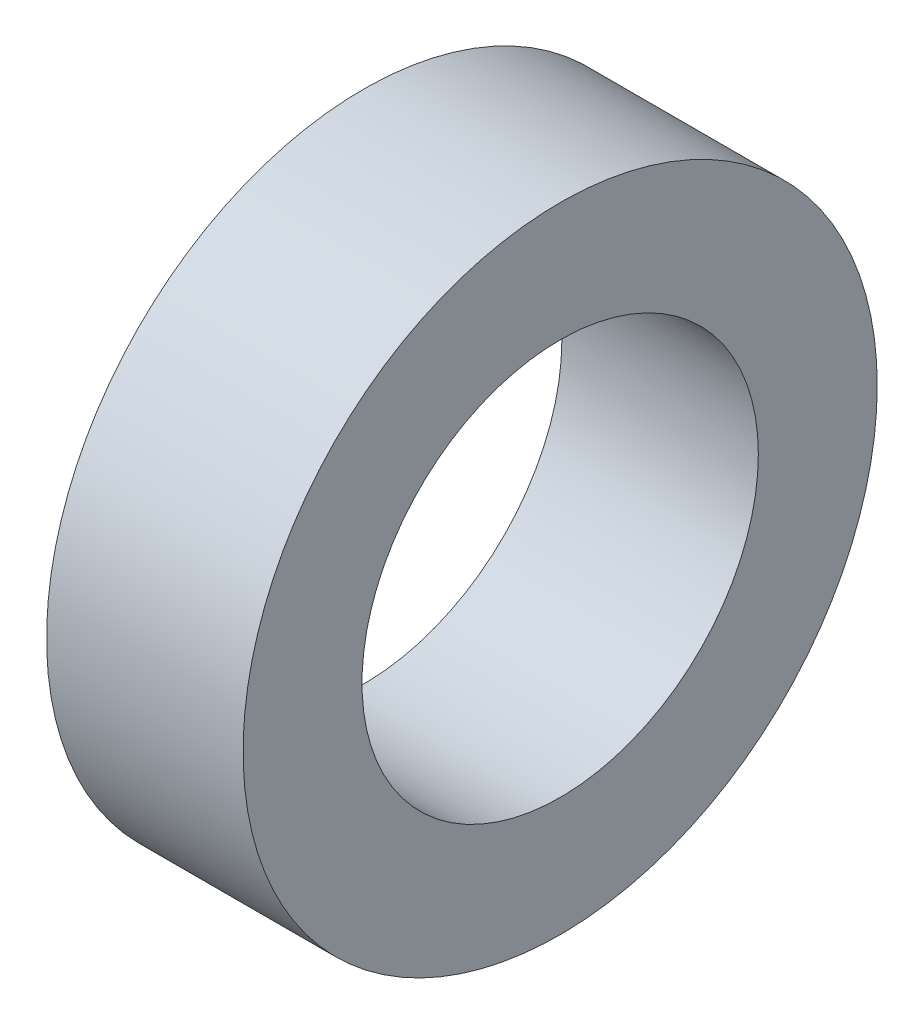
ISO-10303-21;
HEADER;
FILE_DESCRIPTION(('STEP AP214'),'2;1');
FILE_NAME('part.step','',(''),(''),'','','');
FILE_SCHEMA(('AUTOMOTIVE_DESIGN { 1 0 10303 214 1 1 1 1 }'));
ENDSEC;
DATA;
#1=APPLICATION_CONTEXT('core data for automotive mechanical design processes');
#2=APPLICATION_PROTOCOL_DEFINITION('international standard','automotive_design',2000,#1);
#3=PRODUCT_CONTEXT('',#1,'mechanical');
#4=PRODUCT('Part','Part','',(#3));
#5=PRODUCT_RELATED_PRODUCT_CATEGORY('part','',(#4));
#6=PRODUCT_DEFINITION_FORMATION('','',#4);
#7=PRODUCT_DEFINITION_CONTEXT('part definition',#1,'design');
#8=PRODUCT_DEFINITION('design','',#6,#7);
#9=PRODUCT_DEFINITION_SHAPE('','',#8);
#10=(LENGTH_UNIT() NAMED_UNIT(*) SI_UNIT(.MILLI.,.METRE.));
#11=(NAMED_UNIT(*) PLANE_ANGLE_UNIT() SI_UNIT($,.RADIAN.));
#12=(NAMED_UNIT(*) SI_UNIT($,.STERADIAN.) SOLID_ANGLE_UNIT());
#13=UNCERTAINTY_MEASURE_WITH_UNIT(LENGTH_MEASURE(1.E-05),#10,'distance_accuracy_value','');
#14=(GEOMETRIC_REPRESENTATION_CONTEXT(3) GLOBAL_UNCERTAINTY_ASSIGNED_CONTEXT((#13)) GLOBAL_UNIT_ASSIGNED_CONTEXT((#10,
#11,#12)) REPRESENTATION_CONTEXT('',''));
#15=CARTESIAN_POINT('',(0.,0.,0.));
#16=DIRECTION('',(0.,0.,1.));
#17=DIRECTION('',(1.,0.,0.));
#18=AXIS2_PLACEMENT_3D('',#15,#16,#17);
#19=CARTESIAN_POINT('',(6.29666,0.,0.));
#20=DIRECTION('',(1.,0.,0.));
#21=DIRECTION('',(0.,0.,-1.));
#22=AXIS2_PLACEMENT_3D('',#19,#20,#21);
#23=PLANE('',#22);
#24=CARTESIAN_POINT('',(6.29666,0.,0.));
#25=DIRECTION('',(1.,0.,0.));
#26=DIRECTION('',(0.,0.,-1.));
#27=AXIS2_PLACEMENT_3D('',#24,#25,#26);
#28=CIRCLE('',#27,10.16);
#29=CARTESIAN_POINT('',(6.29666,0.,-10.16));
#30=VERTEX_POINT('',#29);
#31=EDGE_CURVE('E10',#30,#30,#28,.T.);
#32=ORIENTED_EDGE('',*,*,#31,.T.);
#33=EDGE_LOOP('',(#32));
#34=FACE_BOUND('',#33,.T.);
#35=CARTESIAN_POINT('',(6.29666,0.,0.));
#36=DIRECTION('',(1.,0.,0.));
#37=DIRECTION('',(0.,0.,-1.));
#38=AXIS2_PLACEMENT_3D('',#35,#36,#37);
#39=CIRCLE('',#38,6.35);
#40=CARTESIAN_POINT('',(6.29666,0.,-6.35));
#41=VERTEX_POINT('',#40);
#42=EDGE_CURVE('E41',#41,#41,#39,.T.);
#43=ORIENTED_EDGE('',*,*,#42,.F.);
#44=EDGE_LOOP('',(#43));
#45=FACE_BOUND('',#44,.T.);
#46=ADVANCED_FACE('F30',(#34,#45),#23,.T.);
#47=CARTESIAN_POINT('',(0.,0.,0.));
#48=DIRECTION('',(1.,0.,0.));
#49=DIRECTION('',(0.,0.,-1.));
#50=AXIS2_PLACEMENT_3D('',#47,#48,#49);
#51=PLANE('',#50);
#52=CARTESIAN_POINT('',(0.,0.,0.));
#53=DIRECTION('',(1.,0.,0.));
#54=DIRECTION('',(0.,0.,-1.));
#55=AXIS2_PLACEMENT_3D('',#52,#53,#54);
#56=CIRCLE('',#55,10.16);
#57=CARTESIAN_POINT('',(0.,0.,-10.16));
#58=VERTEX_POINT('',#57);
#59=EDGE_CURVE('E34',#58,#58,#56,.T.);
#60=ORIENTED_EDGE('',*,*,#59,.F.);
#61=EDGE_LOOP('',(#60));
#62=FACE_BOUND('',#61,.T.);
#63=CARTESIAN_POINT('',(0.,0.,0.));
#64=DIRECTION('',(1.,0.,0.));
#65=DIRECTION('',(0.,0.,-1.));
#66=AXIS2_PLACEMENT_3D('',#63,#64,#65);
#67=CIRCLE('',#66,6.35);
#68=CARTESIAN_POINT('',(0.,0.,-6.35));
#69=VERTEX_POINT('',#68);
#70=EDGE_CURVE('E43',#69,#69,#67,.T.);
#71=ORIENTED_EDGE('',*,*,#70,.T.);
#72=EDGE_LOOP('',(#71));
#73=FACE_BOUND('',#72,.T.);
#74=ADVANCED_FACE('F53',(#62,#73),#51,.F.);
#75=CARTESIAN_POINT('',(6.29666,0.,0.));
#76=DIRECTION('',(-1.,0.,0.));
#77=DIRECTION('',(0.,0.,1.));
#78=AXIS2_PLACEMENT_3D('',#75,#76,#77);
#79=CYLINDRICAL_SURFACE('',#78,10.16);
#80=ORIENTED_EDGE('',*,*,#31,.F.);
#81=EDGE_LOOP('',(#80));
#82=FACE_BOUND('',#81,.T.);
#83=ORIENTED_EDGE('',*,*,#59,.T.);
#84=EDGE_LOOP('',(#83));
#85=FACE_BOUND('',#84,.T.);
#86=ADVANCED_FACE('F32',(#82,#85),#79,.T.);
#87=CARTESIAN_POINT('',(6.29666,0.,0.));
#88=DIRECTION('',(-1.,0.,0.));
#89=DIRECTION('',(0.,0.,1.));
#90=AXIS2_PLACEMENT_3D('',#87,#88,#89);
#91=CYLINDRICAL_SURFACE('',#90,6.35);
#92=ORIENTED_EDGE('',*,*,#42,.T.);
#93=EDGE_LOOP('',(#92));
#94=FACE_BOUND('',#93,.T.);
#95=ORIENTED_EDGE('',*,*,#70,.F.);
#96=EDGE_LOOP('',(#95));
#97=FACE_BOUND('',#96,.T.);
#98=ADVANCED_FACE('F49',(#94,#97),#91,.F.);
#99=CLOSED_SHELL('',(#46,#74,#86,#98));
#100=MANIFOLD_SOLID_BREP('B2',#99);
#101=ADVANCED_BREP_SHAPE_REPRESENTATION('',(#18,#100),#14);
#102=SHAPE_DEFINITION_REPRESENTATION(#9,#101);
ENDSEC;
END-ISO-10303-21;
